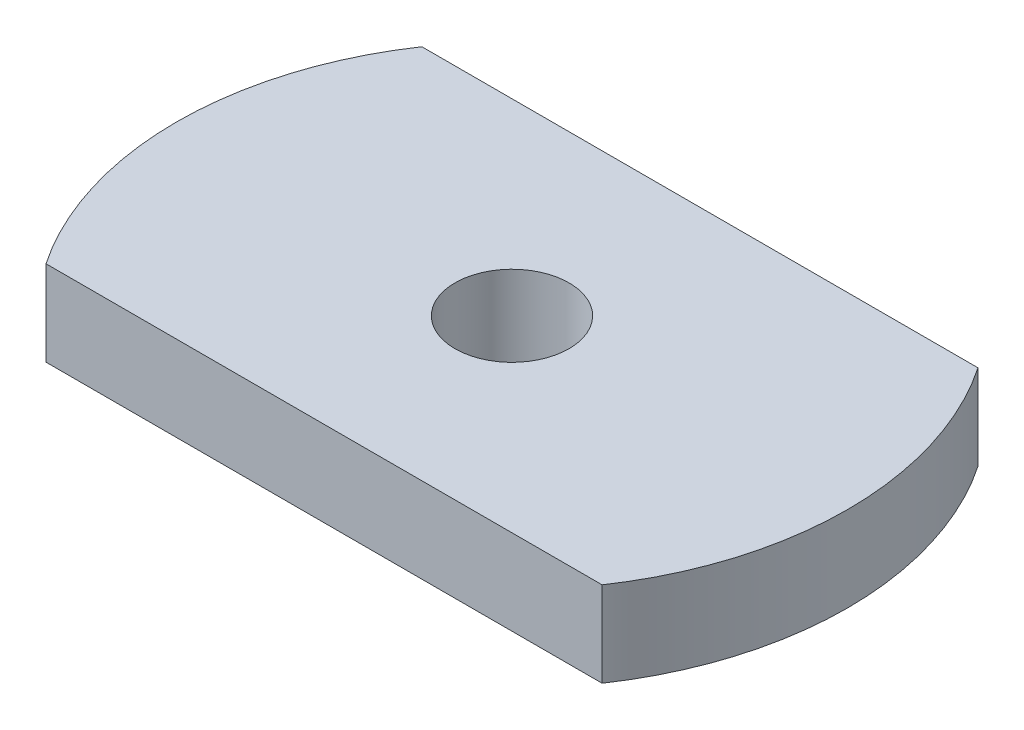
ISO-10303-21;
HEADER;
FILE_DESCRIPTION(('STEP AP214'),'2;1');
FILE_NAME('part.step','',(''),(''),'','','');
FILE_SCHEMA(('AUTOMOTIVE_DESIGN { 1 0 10303 214 1 1 1 1 }'));
ENDSEC;
DATA;
#1=APPLICATION_CONTEXT('core data for automotive mechanical design processes');
#2=APPLICATION_PROTOCOL_DEFINITION('international standard','automotive_design',2000,#1);
#3=PRODUCT_CONTEXT('',#1,'mechanical');
#4=PRODUCT('Part','Part','',(#3));
#5=PRODUCT_RELATED_PRODUCT_CATEGORY('part','',(#4));
#6=PRODUCT_DEFINITION_FORMATION('','',#4);
#7=PRODUCT_DEFINITION_CONTEXT('part definition',#1,'design');
#8=PRODUCT_DEFINITION('design','',#6,#7);
#9=PRODUCT_DEFINITION_SHAPE('','',#8);
#10=(LENGTH_UNIT() NAMED_UNIT(*) SI_UNIT(.MILLI.,.METRE.));
#11=(NAMED_UNIT(*) PLANE_ANGLE_UNIT() SI_UNIT($,.RADIAN.));
#12=(NAMED_UNIT(*) SI_UNIT($,.STERADIAN.) SOLID_ANGLE_UNIT());
#13=UNCERTAINTY_MEASURE_WITH_UNIT(LENGTH_MEASURE(1.E-05),#10,'distance_accuracy_value','');
#14=(GEOMETRIC_REPRESENTATION_CONTEXT(3) GLOBAL_UNCERTAINTY_ASSIGNED_CONTEXT((#13)) GLOBAL_UNIT_ASSIGNED_CONTEXT((#10,
#11,#12)) REPRESENTATION_CONTEXT('',''));
#15=CARTESIAN_POINT('',(0.,0.,0.));
#16=DIRECTION('',(0.,0.,1.));
#17=DIRECTION('',(1.,0.,0.));
#18=AXIS2_PLACEMENT_3D('',#15,#16,#17);
#19=CARTESIAN_POINT('',(0.,6.35,0.));
#20=DIRECTION('',(0.,1.,0.));
#21=DIRECTION('',(0.,0.,1.));
#22=AXIS2_PLACEMENT_3D('',#19,#20,#21);
#23=PLANE('',#22);
#24=CARTESIAN_POINT('',(0.,6.35,0.));
#25=DIRECTION('',(0.,1.,0.));
#26=DIRECTION('',(0.,0.,1.));
#27=AXIS2_PLACEMENT_3D('',#24,#25,#26);
#28=CIRCLE('',#27,25.);
#29=CARTESIAN_POINT('',(-20.712315177208,6.35,-14.));
#30=VERTEX_POINT('',#29);
#31=CARTESIAN_POINT('',(-20.712315177208,6.35,14.));
#32=VERTEX_POINT('',#31);
#33=EDGE_CURVE('E87',#30,#32,#28,.T.);
#34=ORIENTED_EDGE('',*,*,#33,.T.);
#35=DIRECTION('',(1.,0.,0.));
#36=VECTOR('',#35,1.);
#37=CARTESIAN_POINT('',(-20.712315177208,6.35,14.));
#38=LINE('',#37,#36);
#39=CARTESIAN_POINT('',(20.712315177208,6.35,14.));
#40=VERTEX_POINT('',#39);
#41=EDGE_CURVE('E82',#32,#40,#38,.T.);
#42=ORIENTED_EDGE('',*,*,#41,.T.);
#43=CARTESIAN_POINT('',(0.,6.35,0.));
#44=DIRECTION('',(0.,1.,0.));
#45=DIRECTION('',(0.,0.,1.));
#46=AXIS2_PLACEMENT_3D('',#43,#44,#45);
#47=CIRCLE('',#46,25.);
#48=CARTESIAN_POINT('',(20.712315177208,6.35,-14.));
#49=VERTEX_POINT('',#48);
#50=EDGE_CURVE('E85',#40,#49,#47,.T.);
#51=ORIENTED_EDGE('',*,*,#50,.T.);
#52=DIRECTION('',(-1.,0.,0.));
#53=VECTOR('',#52,1.);
#54=CARTESIAN_POINT('',(-20.712315177208,6.35,-14.));
#55=LINE('',#54,#53);
#56=EDGE_CURVE('E52',#49,#30,#55,.T.);
#57=ORIENTED_EDGE('',*,*,#56,.T.);
#58=EDGE_LOOP('',(#34,#42,#51,#57));
#59=FACE_BOUND('',#58,.T.);
#60=CARTESIAN_POINT('',(0.,6.35,0.));
#61=DIRECTION('',(0.,1.,0.));
#62=DIRECTION('',(0.,0.,1.));
#63=AXIS2_PLACEMENT_3D('',#60,#61,#62);
#64=CIRCLE('',#63,4.25);
#65=CARTESIAN_POINT('',(0.,6.35,4.25));
#66=VERTEX_POINT('',#65);
#67=EDGE_CURVE('E102',#66,#66,#64,.T.);
#68=ORIENTED_EDGE('',*,*,#67,.F.);
#69=EDGE_LOOP('',(#68));
#70=FACE_BOUND('',#69,.T.);
#71=ADVANCED_FACE('F35',(#59,#70),#23,.T.);
#72=CARTESIAN_POINT('',(0.,0.,0.));
#73=DIRECTION('',(0.,1.,0.));
#74=DIRECTION('',(0.,0.,1.));
#75=AXIS2_PLACEMENT_3D('',#72,#73,#74);
#76=PLANE('',#75);
#77=CARTESIAN_POINT('',(0.,0.,0.));
#78=DIRECTION('',(0.,1.,0.));
#79=DIRECTION('',(0.,0.,1.));
#80=AXIS2_PLACEMENT_3D('',#77,#78,#79);
#81=CIRCLE('',#80,25.);
#82=CARTESIAN_POINT('',(-20.712315177208,0.,-14.));
#83=VERTEX_POINT('',#82);
#84=CARTESIAN_POINT('',(-20.712315177208,0.,14.));
#85=VERTEX_POINT('',#84);
#86=EDGE_CURVE('E99',#83,#85,#81,.T.);
#87=ORIENTED_EDGE('',*,*,#86,.F.);
#88=DIRECTION('',(-1.,0.,0.));
#89=VECTOR('',#88,1.);
#90=CARTESIAN_POINT('',(-20.712315177208,0.,-14.));
#91=LINE('',#90,#89);
#92=CARTESIAN_POINT('',(20.712315177208,0.,-14.));
#93=VERTEX_POINT('',#92);
#94=EDGE_CURVE('E75',#93,#83,#91,.T.);
#95=ORIENTED_EDGE('',*,*,#94,.F.);
#96=CARTESIAN_POINT('',(0.,0.,0.));
#97=DIRECTION('',(0.,1.,0.));
#98=DIRECTION('',(0.,0.,1.));
#99=AXIS2_PLACEMENT_3D('',#96,#97,#98);
#100=CIRCLE('',#99,25.);
#101=CARTESIAN_POINT('',(20.712315177208,0.,14.));
#102=VERTEX_POINT('',#101);
#103=EDGE_CURVE('E69',#102,#93,#100,.T.);
#104=ORIENTED_EDGE('',*,*,#103,.F.);
#105=DIRECTION('',(1.,0.,0.));
#106=VECTOR('',#105,1.);
#107=CARTESIAN_POINT('',(-20.712315177208,0.,14.));
#108=LINE('',#107,#106);
#109=EDGE_CURVE('E91',#85,#102,#108,.T.);
#110=ORIENTED_EDGE('',*,*,#109,.F.);
#111=EDGE_LOOP('',(#87,#95,#104,#110));
#112=FACE_BOUND('',#111,.T.);
#113=CARTESIAN_POINT('',(0.,0.,0.));
#114=DIRECTION('',(0.,1.,0.));
#115=DIRECTION('',(0.,0.,1.));
#116=AXIS2_PLACEMENT_3D('',#113,#114,#115);
#117=CIRCLE('',#116,4.25);
#118=CARTESIAN_POINT('',(0.,0.,4.25));
#119=VERTEX_POINT('',#118);
#120=EDGE_CURVE('E114',#119,#119,#117,.T.);
#121=ORIENTED_EDGE('',*,*,#120,.T.);
#122=EDGE_LOOP('',(#121));
#123=FACE_BOUND('',#122,.T.);
#124=ADVANCED_FACE('F110',(#112,#123),#76,.F.);
#125=CARTESIAN_POINT('',(0.,6.35,0.));
#126=DIRECTION('',(0.,-1.,0.));
#127=DIRECTION('',(0.,0.,-1.));
#128=AXIS2_PLACEMENT_3D('',#125,#126,#127);
#129=CYLINDRICAL_SURFACE('',#128,25.);
#130=ORIENTED_EDGE('',*,*,#86,.T.);
#131=DIRECTION('',(0.,-1.,0.));
#132=VECTOR('',#131,1.);
#133=CARTESIAN_POINT('',(-20.712315177208,6.35,14.));
#134=LINE('',#133,#132);
#135=EDGE_CURVE('E11',#32,#85,#134,.T.);
#136=ORIENTED_EDGE('',*,*,#135,.F.);
#137=ORIENTED_EDGE('',*,*,#33,.F.);
#138=DIRECTION('',(0.,-1.,0.));
#139=VECTOR('',#138,1.);
#140=CARTESIAN_POINT('',(-20.712315177208,6.35,-14.));
#141=LINE('',#140,#139);
#142=EDGE_CURVE('E95',#30,#83,#141,.T.);
#143=ORIENTED_EDGE('',*,*,#142,.T.);
#144=EDGE_LOOP('',(#130,#136,#137,#143));
#145=FACE_BOUND('',#144,.T.);
#146=ADVANCED_FACE('F37',(#145),#129,.T.);
#147=CARTESIAN_POINT('',(-20.712315177208,6.35,14.));
#148=DIRECTION('',(0.,0.,-1.));
#149=DIRECTION('',(-1.,0.,0.));
#150=AXIS2_PLACEMENT_3D('',#147,#148,#149);
#151=PLANE('',#150);
#152=ORIENTED_EDGE('',*,*,#109,.T.);
#153=DIRECTION('',(0.,-1.,0.));
#154=VECTOR('',#153,1.);
#155=CARTESIAN_POINT('',(20.712315177208,6.35,14.));
#156=LINE('',#155,#154);
#157=EDGE_CURVE('E44',#40,#102,#156,.T.);
#158=ORIENTED_EDGE('',*,*,#157,.F.);
#159=ORIENTED_EDGE('',*,*,#41,.F.);
#160=ORIENTED_EDGE('',*,*,#135,.T.);
#161=EDGE_LOOP('',(#152,#158,#159,#160));
#162=FACE_BOUND('',#161,.T.);
#163=ADVANCED_FACE('F90',(#162),#151,.F.);
#164=CARTESIAN_POINT('',(0.,6.35,0.));
#165=DIRECTION('',(0.,-1.,0.));
#166=DIRECTION('',(0.,0.,-1.));
#167=AXIS2_PLACEMENT_3D('',#164,#165,#166);
#168=CYLINDRICAL_SURFACE('',#167,25.);
#169=ORIENTED_EDGE('',*,*,#103,.T.);
#170=DIRECTION('',(0.,-1.,0.));
#171=VECTOR('',#170,1.);
#172=CARTESIAN_POINT('',(20.712315177208,6.35,-14.));
#173=LINE('',#172,#171);
#174=EDGE_CURVE('E92',#49,#93,#173,.T.);
#175=ORIENTED_EDGE('',*,*,#174,.F.);
#176=ORIENTED_EDGE('',*,*,#50,.F.);
#177=ORIENTED_EDGE('',*,*,#157,.T.);
#178=EDGE_LOOP('',(#169,#175,#176,#177));
#179=FACE_BOUND('',#178,.T.);
#180=ADVANCED_FACE('F93',(#179),#168,.T.);
#181=CARTESIAN_POINT('',(-20.712315177208,6.35,-14.));
#182=DIRECTION('',(0.,0.,1.));
#183=DIRECTION('',(1.,0.,0.));
#184=AXIS2_PLACEMENT_3D('',#181,#182,#183);
#185=PLANE('',#184);
#186=ORIENTED_EDGE('',*,*,#94,.T.);
#187=ORIENTED_EDGE('',*,*,#142,.F.);
#188=ORIENTED_EDGE('',*,*,#56,.F.);
#189=ORIENTED_EDGE('',*,*,#174,.T.);
#190=EDGE_LOOP('',(#186,#187,#188,#189));
#191=FACE_BOUND('',#190,.T.);
#192=ADVANCED_FACE('F107',(#191),#185,.F.);
#193=CARTESIAN_POINT('',(0.,6.35,0.));
#194=DIRECTION('',(0.,-1.,0.));
#195=DIRECTION('',(0.,0.,-1.));
#196=AXIS2_PLACEMENT_3D('',#193,#194,#195);
#197=CYLINDRICAL_SURFACE('',#196,4.25);
#198=ORIENTED_EDGE('',*,*,#67,.T.);
#199=EDGE_LOOP('',(#198));
#200=FACE_BOUND('',#199,.T.);
#201=ORIENTED_EDGE('',*,*,#120,.F.);
#202=EDGE_LOOP('',(#201));
#203=FACE_BOUND('',#202,.T.);
#204=ADVANCED_FACE('F120',(#200,#203),#197,.F.);
#205=CLOSED_SHELL('',(#71,#124,#146,#163,#180,#192,#204));
#206=MANIFOLD_SOLID_BREP('B2',#205);
#207=ADVANCED_BREP_SHAPE_REPRESENTATION('',(#18,#206),#14);
#208=SHAPE_DEFINITION_REPRESENTATION(#9,#207);
ENDSEC;
END-ISO-10303-21;
